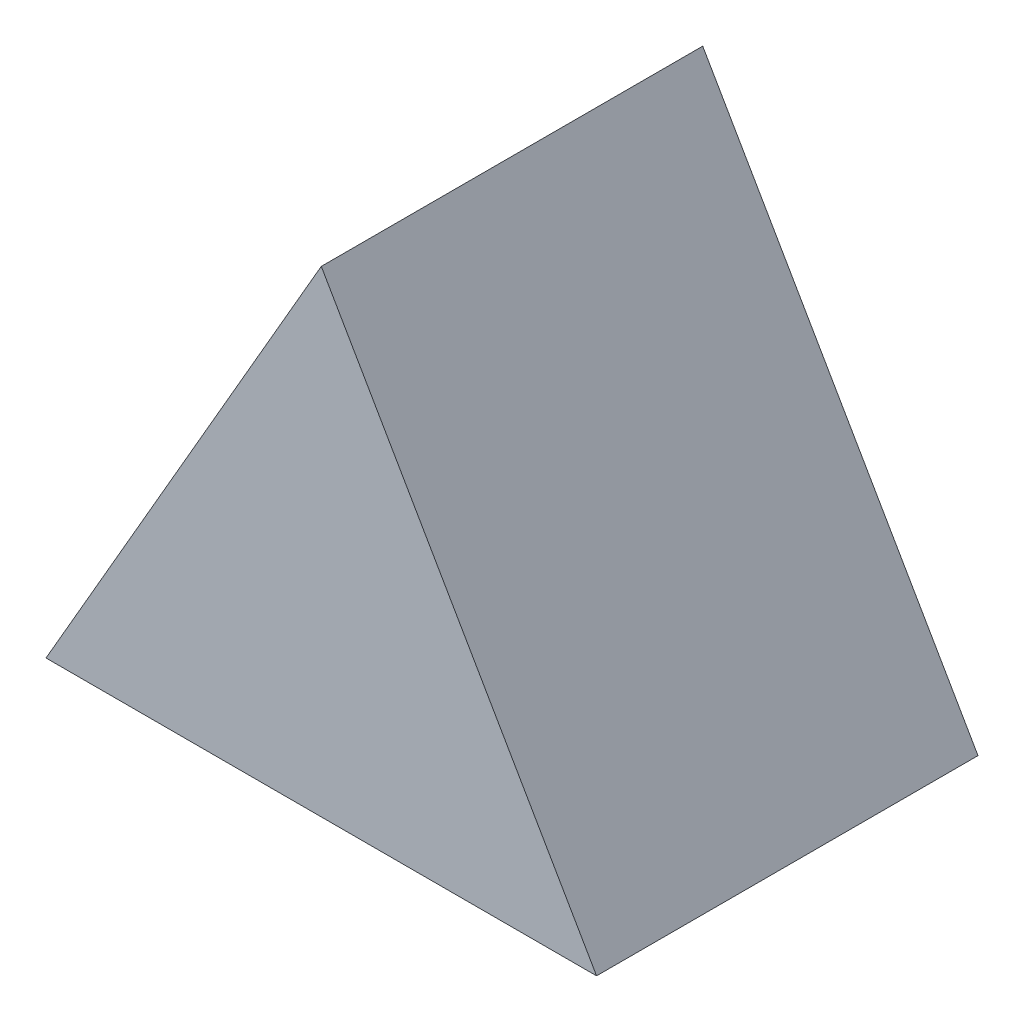
ISO-10303-21;
HEADER;
FILE_DESCRIPTION(('STEP AP214'),'2;1');
FILE_NAME('part.step','',(''),(''),'','','');
FILE_SCHEMA(('AUTOMOTIVE_DESIGN { 1 0 10303 214 1 1 1 1 }'));
ENDSEC;
DATA;
#1=APPLICATION_CONTEXT('core data for automotive mechanical design processes');
#2=APPLICATION_PROTOCOL_DEFINITION('international standard','automotive_design',2000,#1);
#3=PRODUCT_CONTEXT('',#1,'mechanical');
#4=PRODUCT('Part','Part','',(#3));
#5=PRODUCT_RELATED_PRODUCT_CATEGORY('part','',(#4));
#6=PRODUCT_DEFINITION_FORMATION('','',#4);
#7=PRODUCT_DEFINITION_CONTEXT('part definition',#1,'design');
#8=PRODUCT_DEFINITION('design','',#6,#7);
#9=PRODUCT_DEFINITION_SHAPE('','',#8);
#10=(LENGTH_UNIT() NAMED_UNIT(*) SI_UNIT(.MILLI.,.METRE.));
#11=(NAMED_UNIT(*) PLANE_ANGLE_UNIT() SI_UNIT($,.RADIAN.));
#12=(NAMED_UNIT(*) SI_UNIT($,.STERADIAN.) SOLID_ANGLE_UNIT());
#13=UNCERTAINTY_MEASURE_WITH_UNIT(LENGTH_MEASURE(1.E-05),#10,'distance_accuracy_value','');
#14=(GEOMETRIC_REPRESENTATION_CONTEXT(3) GLOBAL_UNCERTAINTY_ASSIGNED_CONTEXT((#13)) GLOBAL_UNIT_ASSIGNED_CONTEXT((#10,
#11,#12)) REPRESENTATION_CONTEXT('',''));
#15=CARTESIAN_POINT('',(0.,0.,0.));
#16=DIRECTION('',(0.,0.,1.));
#17=DIRECTION('',(1.,0.,0.));
#18=AXIS2_PLACEMENT_3D('',#15,#16,#17);
#19=CARTESIAN_POINT('',(21.650635094611,-12.5,30.));
#20=DIRECTION('',(-0.866025403784439,-0.5,0.));
#21=DIRECTION('',(0.5,-0.866025403784439,0.));
#22=AXIS2_PLACEMENT_3D('',#19,#20,#21);
#23=PLANE('',#22);
#24=DIRECTION('',(-0.5,0.866025403784439,0.));
#25=VECTOR('',#24,1.);
#26=CARTESIAN_POINT('',(21.650635094611,-12.5,0.));
#27=LINE('',#26,#25);
#28=CARTESIAN_POINT('',(21.650635094611,-12.5,0.));
#29=VERTEX_POINT('',#28);
#30=CARTESIAN_POINT('',(0.,25.,0.));
#31=VERTEX_POINT('',#30);
#32=EDGE_CURVE('E80',#29,#31,#27,.T.);
#33=ORIENTED_EDGE('',*,*,#32,.T.);
#34=DIRECTION('',(0.,0.,-1.));
#35=VECTOR('',#34,1.);
#36=CARTESIAN_POINT('',(0.,25.,30.));
#37=LINE('',#36,#35);
#38=CARTESIAN_POINT('',(0.,25.,30.));
#39=VERTEX_POINT('',#38);
#40=EDGE_CURVE('E11',#39,#31,#37,.T.);
#41=ORIENTED_EDGE('',*,*,#40,.F.);
#42=DIRECTION('',(-0.5,0.866025403784439,0.));
#43=VECTOR('',#42,1.);
#44=CARTESIAN_POINT('',(21.650635094611,-12.5,30.));
#45=LINE('',#44,#43);
#46=CARTESIAN_POINT('',(21.650635094611,-12.5,30.));
#47=VERTEX_POINT('',#46);
#48=EDGE_CURVE('E73',#47,#39,#45,.T.);
#49=ORIENTED_EDGE('',*,*,#48,.F.);
#50=DIRECTION('',(0.,0.,-1.));
#51=VECTOR('',#50,1.);
#52=CARTESIAN_POINT('',(21.650635094611,-12.5,30.));
#53=LINE('',#52,#51);
#54=EDGE_CURVE('E81',#47,#29,#53,.T.);
#55=ORIENTED_EDGE('',*,*,#54,.T.);
#56=EDGE_LOOP('',(#33,#41,#49,#55));
#57=FACE_BOUND('',#56,.T.);
#58=ADVANCED_FACE('F33',(#57),#23,.F.);
#59=CARTESIAN_POINT('',(0.,25.,30.));
#60=DIRECTION('',(0.866025403784439,-0.5,0.));
#61=DIRECTION('',(0.5,0.866025403784439,0.));
#62=AXIS2_PLACEMENT_3D('',#59,#60,#61);
#63=PLANE('',#62);
#64=DIRECTION('',(-0.5,-0.866025403784439,0.));
#65=VECTOR('',#64,1.);
#66=CARTESIAN_POINT('',(0.,25.,0.));
#67=LINE('',#66,#65);
#68=CARTESIAN_POINT('',(-21.650635094611,-12.5,0.));
#69=VERTEX_POINT('',#68);
#70=EDGE_CURVE('E61',#31,#69,#67,.T.);
#71=ORIENTED_EDGE('',*,*,#70,.T.);
#72=DIRECTION('',(0.,0.,-1.));
#73=VECTOR('',#72,1.);
#74=CARTESIAN_POINT('',(-21.650635094611,-12.5,30.));
#75=LINE('',#74,#73);
#76=CARTESIAN_POINT('',(-21.650635094611,-12.5,30.));
#77=VERTEX_POINT('',#76);
#78=EDGE_CURVE('E41',#77,#69,#75,.T.);
#79=ORIENTED_EDGE('',*,*,#78,.F.);
#80=DIRECTION('',(-0.5,-0.866025403784439,0.));
#81=VECTOR('',#80,1.);
#82=CARTESIAN_POINT('',(0.,25.,30.));
#83=LINE('',#82,#81);
#84=EDGE_CURVE('E69',#39,#77,#83,.T.);
#85=ORIENTED_EDGE('',*,*,#84,.F.);
#86=ORIENTED_EDGE('',*,*,#40,.T.);
#87=EDGE_LOOP('',(#71,#79,#85,#86));
#88=FACE_BOUND('',#87,.T.);
#89=ADVANCED_FACE('F70',(#88),#63,.F.);
#90=CARTESIAN_POINT('',(-21.650635094611,-12.5,30.));
#91=DIRECTION('',(0.,1.,0.));
#92=DIRECTION('',(0.,0.,1.));
#93=AXIS2_PLACEMENT_3D('',#90,#91,#92);
#94=PLANE('',#93);
#95=DIRECTION('',(1.,0.,0.));
#96=VECTOR('',#95,1.);
#97=CARTESIAN_POINT('',(-21.650635094611,-12.5,0.));
#98=LINE('',#97,#96);
#99=EDGE_CURVE('E66',#69,#29,#98,.T.);
#100=ORIENTED_EDGE('',*,*,#99,.T.);
#101=ORIENTED_EDGE('',*,*,#54,.F.);
#102=DIRECTION('',(1.,0.,0.));
#103=VECTOR('',#102,1.);
#104=CARTESIAN_POINT('',(-21.650635094611,-12.5,30.));
#105=LINE('',#104,#103);
#106=EDGE_CURVE('E49',#77,#47,#105,.T.);
#107=ORIENTED_EDGE('',*,*,#106,.F.);
#108=ORIENTED_EDGE('',*,*,#78,.T.);
#109=EDGE_LOOP('',(#100,#101,#107,#108));
#110=FACE_BOUND('',#109,.T.);
#111=ADVANCED_FACE('F88',(#110),#94,.F.);
#112=CARTESIAN_POINT('',(0.,0.,30.));
#113=DIRECTION('',(0.,0.,1.));
#114=DIRECTION('',(1.,0.,0.));
#115=AXIS2_PLACEMENT_3D('',#112,#113,#114);
#116=PLANE('',#115);
#117=ORIENTED_EDGE('',*,*,#48,.T.);
#118=ORIENTED_EDGE('',*,*,#84,.T.);
#119=ORIENTED_EDGE('',*,*,#106,.T.);
#120=EDGE_LOOP('',(#117,#118,#119));
#121=FACE_BOUND('',#120,.T.);
#122=ADVANCED_FACE('F76',(#121),#116,.T.);
#123=CARTESIAN_POINT('',(0.,0.,0.));
#124=DIRECTION('',(0.,0.,1.));
#125=DIRECTION('',(1.,0.,0.));
#126=AXIS2_PLACEMENT_3D('',#123,#124,#125);
#127=PLANE('',#126);
#128=ORIENTED_EDGE('',*,*,#32,.F.);
#129=ORIENTED_EDGE('',*,*,#99,.F.);
#130=ORIENTED_EDGE('',*,*,#70,.F.);
#131=EDGE_LOOP('',(#128,#129,#130));
#132=FACE_BOUND('',#131,.T.);
#133=ADVANCED_FACE('F89',(#132),#127,.F.);
#134=CLOSED_SHELL('',(#58,#89,#111,#122,#133));
#135=MANIFOLD_SOLID_BREP('B2',#134);
#136=ADVANCED_BREP_SHAPE_REPRESENTATION('',(#18,#135),#14);
#137=SHAPE_DEFINITION_REPRESENTATION(#9,#136);
ENDSEC;
END-ISO-10303-21;
